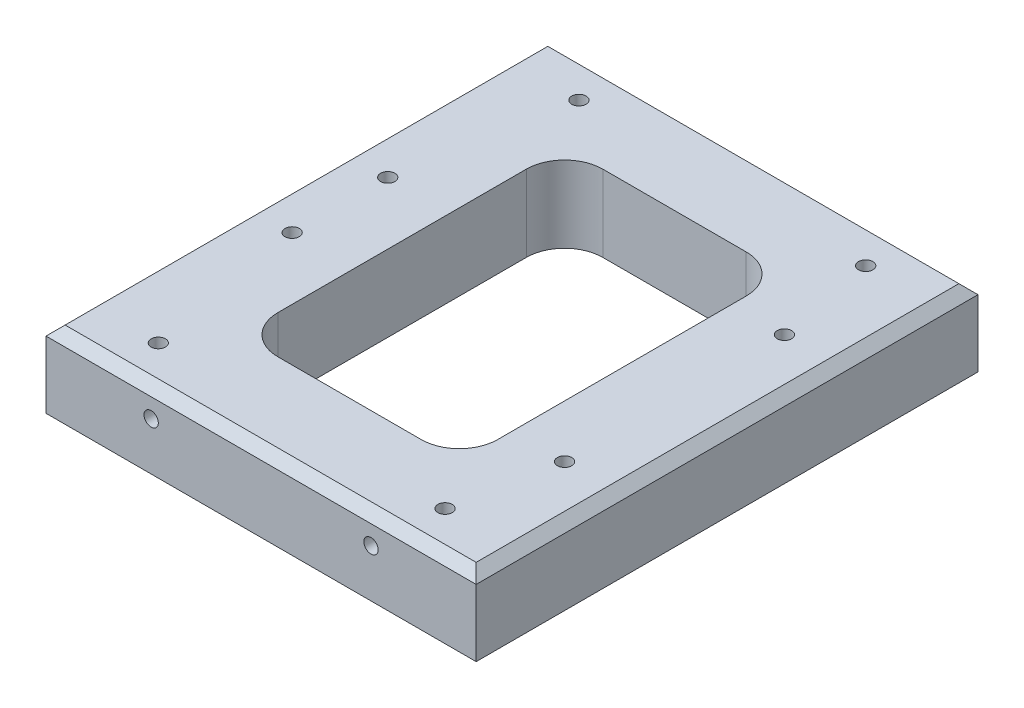
ISO-10303-21;
HEADER;
FILE_DESCRIPTION(('STEP AP214'),'2;1');
FILE_NAME('part.step','',(''),(''),'','','');
FILE_SCHEMA(('AUTOMOTIVE_DESIGN { 1 0 10303 214 1 1 1 1 }'));
ENDSEC;
DATA;
#1=APPLICATION_CONTEXT('core data for automotive mechanical design processes');
#2=APPLICATION_PROTOCOL_DEFINITION('international standard','automotive_design',2000,#1);
#3=PRODUCT_CONTEXT('',#1,'mechanical');
#4=PRODUCT('Part','Part','',(#3));
#5=PRODUCT_RELATED_PRODUCT_CATEGORY('part','',(#4));
#6=PRODUCT_DEFINITION_FORMATION('','',#4);
#7=PRODUCT_DEFINITION_CONTEXT('part definition',#1,'design');
#8=PRODUCT_DEFINITION('design','',#6,#7);
#9=PRODUCT_DEFINITION_SHAPE('','',#8);
#10=(LENGTH_UNIT() NAMED_UNIT(*) SI_UNIT(.MILLI.,.METRE.));
#11=(NAMED_UNIT(*) PLANE_ANGLE_UNIT() SI_UNIT($,.RADIAN.));
#12=(NAMED_UNIT(*) SI_UNIT($,.STERADIAN.) SOLID_ANGLE_UNIT());
#13=UNCERTAINTY_MEASURE_WITH_UNIT(LENGTH_MEASURE(1.E-05),#10,'distance_accuracy_value','');
#14=(GEOMETRIC_REPRESENTATION_CONTEXT(3) GLOBAL_UNCERTAINTY_ASSIGNED_CONTEXT((#13)) GLOBAL_UNIT_ASSIGNED_CONTEXT((#10,
#11,#12)) REPRESENTATION_CONTEXT('',''));
#15=CARTESIAN_POINT('',(0.,0.,0.));
#16=DIRECTION('',(0.,0.,1.));
#17=DIRECTION('',(1.,0.,0.));
#18=AXIS2_PLACEMENT_3D('',#15,#16,#17);
#19=CARTESIAN_POINT('',(0.,16.,0.));
#20=DIRECTION('',(0.,1.,0.));
#21=DIRECTION('',(0.,0.,1.));
#22=AXIS2_PLACEMENT_3D('',#19,#20,#21);
#23=PLANE('',#22);
#24=DIRECTION('',(-1.,0.,0.));
#25=VECTOR('',#24,1.);
#26=CARTESIAN_POINT('',(-45.,16.,-50.5));
#27=LINE('',#26,#25);
#28=CARTESIAN_POINT('',(43.,16.,-50.5));
#29=VERTEX_POINT('',#28);
#30=CARTESIAN_POINT('',(-43.,16.,-50.5));
#31=VERTEX_POINT('',#30);
#32=EDGE_CURVE('E242',#29,#31,#27,.T.);
#33=ORIENTED_EDGE('',*,*,#32,.T.);
#34=DIRECTION('',(0.,0.,1.));
#35=VECTOR('',#34,1.);
#36=CARTESIAN_POINT('',(-43.,16.,52.5));
#37=LINE('',#36,#35);
#38=CARTESIAN_POINT('',(-43.,16.,50.5));
#39=VERTEX_POINT('',#38);
#40=EDGE_CURVE('E244',#31,#39,#37,.T.);
#41=ORIENTED_EDGE('',*,*,#40,.T.);
#42=DIRECTION('',(1.,0.,0.));
#43=VECTOR('',#42,1.);
#44=CARTESIAN_POINT('',(45.,16.,50.5));
#45=LINE('',#44,#43);
#46=CARTESIAN_POINT('',(43.,16.,50.5));
#47=VERTEX_POINT('',#46);
#48=EDGE_CURVE('E238',#39,#47,#45,.T.);
#49=ORIENTED_EDGE('',*,*,#48,.T.);
#50=DIRECTION('',(0.,0.,-1.));
#51=VECTOR('',#50,1.);
#52=CARTESIAN_POINT('',(43.,16.,-52.5));
#53=LINE('',#52,#51);
#54=EDGE_CURVE('E240',#47,#29,#53,.T.);
#55=ORIENTED_EDGE('',*,*,#54,.T.);
#56=EDGE_LOOP('',(#33,#41,#49,#55));
#57=FACE_BOUND('',#56,.T.);
#58=CARTESIAN_POINT('',(34.,16.,-23.));
#59=DIRECTION('',(0.,1.,0.));
#60=DIRECTION('',(0.,0.,1.));
#61=AXIS2_PLACEMENT_3D('',#58,#59,#60);
#62=CIRCLE('',#61,1.5);
#63=CARTESIAN_POINT('',(34.,16.,-21.5));
#64=VERTEX_POINT('',#63);
#65=EDGE_CURVE('E277',#64,#64,#62,.T.);
#66=ORIENTED_EDGE('',*,*,#65,.F.);
#67=EDGE_LOOP('',(#66));
#68=FACE_BOUND('',#67,.T.);
#69=CARTESIAN_POINT('',(-36.,16.,10.));
#70=DIRECTION('',(0.,1.,0.));
#71=DIRECTION('',(0.,0.,1.));
#72=AXIS2_PLACEMENT_3D('',#69,#70,#71);
#73=CIRCLE('',#72,1.5);
#74=CARTESIAN_POINT('',(-36.,16.,11.5));
#75=VERTEX_POINT('',#74);
#76=EDGE_CURVE('E289',#75,#75,#73,.T.);
#77=ORIENTED_EDGE('',*,*,#76,.F.);
#78=EDGE_LOOP('',(#77));
#79=FACE_BOUND('',#78,.T.);
#80=CARTESIAN_POINT('',(30.,16.,44.));
#81=DIRECTION('',(0.,1.,0.));
#82=DIRECTION('',(0.,0.,1.));
#83=AXIS2_PLACEMENT_3D('',#80,#81,#82);
#84=CIRCLE('',#83,1.5);
#85=CARTESIAN_POINT('',(30.,16.,45.5));
#86=VERTEX_POINT('',#85);
#87=EDGE_CURVE('E301',#86,#86,#84,.T.);
#88=ORIENTED_EDGE('',*,*,#87,.F.);
#89=EDGE_LOOP('',(#88));
#90=FACE_BOUND('',#89,.T.);
#91=CARTESIAN_POINT('',(-30.,16.,-44.));
#92=DIRECTION('',(0.,1.,0.));
#93=DIRECTION('',(0.,0.,1.));
#94=AXIS2_PLACEMENT_3D('',#91,#92,#93);
#95=CIRCLE('',#94,1.5);
#96=CARTESIAN_POINT('',(-30.,16.,-42.5));
#97=VERTEX_POINT('',#96);
#98=EDGE_CURVE('E188',#97,#97,#95,.T.);
#99=ORIENTED_EDGE('',*,*,#98,.F.);
#100=EDGE_LOOP('',(#99));
#101=FACE_BOUND('',#100,.T.);
#102=DIRECTION('',(1.,0.,0.));
#103=VECTOR('',#102,1.);
#104=CARTESIAN_POINT('',(-14.9999999999999,16.,34.));
#105=LINE('',#104,#103);
#106=CARTESIAN_POINT('',(-14.9999999999999,16.,34.));
#107=VERTEX_POINT('',#106);
#108=CARTESIAN_POINT('',(15.,16.,34.));
#109=VERTEX_POINT('',#108);
#110=EDGE_CURVE('E156',#107,#109,#105,.T.);
#111=ORIENTED_EDGE('',*,*,#110,.F.);
#112=CARTESIAN_POINT('',(-15.,16.,26.));
#113=DIRECTION('',(0.,1.,0.));
#114=DIRECTION('',(0.,0.,-1.));
#115=AXIS2_PLACEMENT_3D('',#112,#113,#114);
#116=CIRCLE('',#115,8.);
#117=CARTESIAN_POINT('',(-23.,16.,25.9999999999999));
#118=VERTEX_POINT('',#117);
#119=EDGE_CURVE('E146',#118,#107,#116,.T.);
#120=ORIENTED_EDGE('',*,*,#119,.F.);
#121=DIRECTION('',(0.,0.,1.));
#122=VECTOR('',#121,1.);
#123=CARTESIAN_POINT('',(-23.,16.,25.9999999999999));
#124=LINE('',#123,#122);
#125=CARTESIAN_POINT('',(-23.,16.,-26.));
#126=VERTEX_POINT('',#125);
#127=EDGE_CURVE('E184',#126,#118,#124,.T.);
#128=ORIENTED_EDGE('',*,*,#127,.F.);
#129=CARTESIAN_POINT('',(-15.,16.,-26.));
#130=DIRECTION('',(0.,1.,0.));
#131=DIRECTION('',(0.,0.,-1.));
#132=AXIS2_PLACEMENT_3D('',#129,#130,#131);
#133=CIRCLE('',#132,8.);
#134=CARTESIAN_POINT('',(-14.9999999999999,16.,-34.));
#135=VERTEX_POINT('',#134);
#136=EDGE_CURVE('E181',#135,#126,#133,.T.);
#137=ORIENTED_EDGE('',*,*,#136,.F.);
#138=DIRECTION('',(-1.,0.,0.));
#139=VECTOR('',#138,1.);
#140=CARTESIAN_POINT('',(-14.9999999999999,16.,-34.));
#141=LINE('',#140,#139);
#142=CARTESIAN_POINT('',(15.,16.,-34.));
#143=VERTEX_POINT('',#142);
#144=EDGE_CURVE('E179',#143,#135,#141,.T.);
#145=ORIENTED_EDGE('',*,*,#144,.F.);
#146=CARTESIAN_POINT('',(15.,16.,-26.));
#147=DIRECTION('',(0.,1.,0.));
#148=DIRECTION('',(0.,0.,-1.));
#149=AXIS2_PLACEMENT_3D('',#146,#147,#148);
#150=CIRCLE('',#149,8.);
#151=CARTESIAN_POINT('',(23.,16.,-26.));
#152=VERTEX_POINT('',#151);
#153=EDGE_CURVE('E177',#152,#143,#150,.T.);
#154=ORIENTED_EDGE('',*,*,#153,.F.);
#155=DIRECTION('',(0.,0.,-1.));
#156=VECTOR('',#155,1.);
#157=CARTESIAN_POINT('',(23.,16.,25.9999999999999));
#158=LINE('',#157,#156);
#159=CARTESIAN_POINT('',(23.,16.,25.9999999999999));
#160=VERTEX_POINT('',#159);
#161=EDGE_CURVE('E172',#160,#152,#158,.T.);
#162=ORIENTED_EDGE('',*,*,#161,.F.);
#163=CARTESIAN_POINT('',(15.,16.,26.));
#164=DIRECTION('',(0.,1.,0.));
#165=DIRECTION('',(0.,0.,1.));
#166=AXIS2_PLACEMENT_3D('',#163,#164,#165);
#167=CIRCLE('',#166,8.);
#168=EDGE_CURVE('E170',#109,#160,#167,.T.);
#169=ORIENTED_EDGE('',*,*,#168,.F.);
#170=EDGE_LOOP('',(#111,#120,#128,#137,#145,#154,#162,#169));
#171=FACE_BOUND('',#170,.T.);
#172=CARTESIAN_POINT('',(30.,16.,-44.));
#173=DIRECTION('',(0.,1.,0.));
#174=DIRECTION('',(0.,0.,1.));
#175=AXIS2_PLACEMENT_3D('',#172,#173,#174);
#176=CIRCLE('',#175,1.5);
#177=CARTESIAN_POINT('',(30.,16.,-42.5));
#178=VERTEX_POINT('',#177);
#179=EDGE_CURVE('E307',#178,#178,#176,.T.);
#180=ORIENTED_EDGE('',*,*,#179,.F.);
#181=EDGE_LOOP('',(#180));
#182=FACE_BOUND('',#181,.T.);
#183=CARTESIAN_POINT('',(-30.,16.,44.));
#184=DIRECTION('',(0.,1.,0.));
#185=DIRECTION('',(0.,0.,1.));
#186=AXIS2_PLACEMENT_3D('',#183,#184,#185);
#187=CIRCLE('',#186,1.5);
#188=CARTESIAN_POINT('',(-30.,16.,45.5));
#189=VERTEX_POINT('',#188);
#190=EDGE_CURVE('E295',#189,#189,#187,.T.);
#191=ORIENTED_EDGE('',*,*,#190,.F.);
#192=EDGE_LOOP('',(#191));
#193=FACE_BOUND('',#192,.T.);
#194=CARTESIAN_POINT('',(-36.,16.,-10.));
#195=DIRECTION('',(0.,1.,0.));
#196=DIRECTION('',(0.,0.,-1.));
#197=AXIS2_PLACEMENT_3D('',#194,#195,#196);
#198=CIRCLE('',#197,1.5);
#199=CARTESIAN_POINT('',(-36.,16.,-11.5));
#200=VERTEX_POINT('',#199);
#201=EDGE_CURVE('E283',#200,#200,#198,.T.);
#202=ORIENTED_EDGE('',*,*,#201,.F.);
#203=EDGE_LOOP('',(#202));
#204=FACE_BOUND('',#203,.T.);
#205=CARTESIAN_POINT('',(34.,16.,23.));
#206=DIRECTION('',(0.,1.,0.));
#207=DIRECTION('',(0.,0.,-1.));
#208=AXIS2_PLACEMENT_3D('',#205,#206,#207);
#209=CIRCLE('',#208,1.5);
#210=CARTESIAN_POINT('',(34.,16.,21.5));
#211=VERTEX_POINT('',#210);
#212=EDGE_CURVE('E268',#211,#211,#209,.T.);
#213=ORIENTED_EDGE('',*,*,#212,.F.);
#214=EDGE_LOOP('',(#213));
#215=FACE_BOUND('',#214,.T.);
#216=ADVANCED_FACE('F42',(#57,#68,#79,#90,#101,#171,#182,#193,#204,#215),#23,.T.);
#217=CARTESIAN_POINT('',(0.,0.,0.));
#218=DIRECTION('',(0.,1.,0.));
#219=DIRECTION('',(0.,0.,1.));
#220=AXIS2_PLACEMENT_3D('',#217,#218,#219);
#221=PLANE('',#220);
#222=DIRECTION('',(0.,0.,-1.));
#223=VECTOR('',#222,1.);
#224=CARTESIAN_POINT('',(45.,0.,-52.5));
#225=LINE('',#224,#223);
#226=CARTESIAN_POINT('',(45.,0.,52.5));
#227=VERTEX_POINT('',#226);
#228=CARTESIAN_POINT('',(45.,0.,-52.5));
#229=VERTEX_POINT('',#228);
#230=EDGE_CURVE('E164',#227,#229,#225,.T.);
#231=ORIENTED_EDGE('',*,*,#230,.F.);
#232=DIRECTION('',(1.,0.,0.));
#233=VECTOR('',#232,1.);
#234=CARTESIAN_POINT('',(-45.,0.,52.5));
#235=LINE('',#234,#233);
#236=CARTESIAN_POINT('',(-45.,0.,52.5));
#237=VERTEX_POINT('',#236);
#238=EDGE_CURVE('E227',#237,#227,#235,.T.);
#239=ORIENTED_EDGE('',*,*,#238,.F.);
#240=DIRECTION('',(0.,0.,1.));
#241=VECTOR('',#240,1.);
#242=CARTESIAN_POINT('',(-45.,0.,-52.5));
#243=LINE('',#242,#241);
#244=CARTESIAN_POINT('',(-45.,0.,-52.5));
#245=VERTEX_POINT('',#244);
#246=EDGE_CURVE('E224',#245,#237,#243,.T.);
#247=ORIENTED_EDGE('',*,*,#246,.F.);
#248=DIRECTION('',(-1.,0.,0.));
#249=VECTOR('',#248,1.);
#250=CARTESIAN_POINT('',(-45.,0.,-52.5));
#251=LINE('',#250,#249);
#252=EDGE_CURVE('E221',#229,#245,#251,.T.);
#253=ORIENTED_EDGE('',*,*,#252,.F.);
#254=EDGE_LOOP('',(#231,#239,#247,#253));
#255=FACE_BOUND('',#254,.T.);
#256=CARTESIAN_POINT('',(-15.,0.,26.));
#257=DIRECTION('',(0.,1.,0.));
#258=DIRECTION('',(0.,0.,-1.));
#259=AXIS2_PLACEMENT_3D('',#256,#257,#258);
#260=CIRCLE('',#259,8.);
#261=CARTESIAN_POINT('',(-23.,0.,25.9999999999999));
#262=VERTEX_POINT('',#261);
#263=CARTESIAN_POINT('',(-14.9999999999999,0.,34.));
#264=VERTEX_POINT('',#263);
#265=EDGE_CURVE('E186',#262,#264,#260,.T.);
#266=ORIENTED_EDGE('',*,*,#265,.T.);
#267=DIRECTION('',(1.,0.,0.));
#268=VECTOR('',#267,1.);
#269=CARTESIAN_POINT('',(-14.9999999999999,0.,34.));
#270=LINE('',#269,#268);
#271=CARTESIAN_POINT('',(15.,0.,34.));
#272=VERTEX_POINT('',#271);
#273=EDGE_CURVE('E163',#264,#272,#270,.T.);
#274=ORIENTED_EDGE('',*,*,#273,.T.);
#275=CARTESIAN_POINT('',(15.,0.,26.));
#276=DIRECTION('',(0.,1.,0.));
#277=DIRECTION('',(0.,0.,1.));
#278=AXIS2_PLACEMENT_3D('',#275,#276,#277);
#279=CIRCLE('',#278,8.);
#280=CARTESIAN_POINT('',(23.,0.,25.9999999999999));
#281=VERTEX_POINT('',#280);
#282=EDGE_CURVE('E190',#272,#281,#279,.T.);
#283=ORIENTED_EDGE('',*,*,#282,.T.);
#284=DIRECTION('',(0.,0.,-1.));
#285=VECTOR('',#284,1.);
#286=CARTESIAN_POINT('',(23.,0.,25.9999999999999));
#287=LINE('',#286,#285);
#288=CARTESIAN_POINT('',(23.,0.,-26.));
#289=VERTEX_POINT('',#288);
#290=EDGE_CURVE('E193',#281,#289,#287,.T.);
#291=ORIENTED_EDGE('',*,*,#290,.T.);
#292=CARTESIAN_POINT('',(15.,0.,-26.));
#293=DIRECTION('',(0.,1.,0.));
#294=DIRECTION('',(0.,0.,-1.));
#295=AXIS2_PLACEMENT_3D('',#292,#293,#294);
#296=CIRCLE('',#295,8.);
#297=CARTESIAN_POINT('',(15.,0.,-34.));
#298=VERTEX_POINT('',#297);
#299=EDGE_CURVE('E196',#289,#298,#296,.T.);
#300=ORIENTED_EDGE('',*,*,#299,.T.);
#301=DIRECTION('',(-1.,0.,0.));
#302=VECTOR('',#301,1.);
#303=CARTESIAN_POINT('',(-14.9999999999999,0.,-34.));
#304=LINE('',#303,#302);
#305=CARTESIAN_POINT('',(-14.9999999999999,0.,-34.));
#306=VERTEX_POINT('',#305);
#307=EDGE_CURVE('E199',#298,#306,#304,.T.);
#308=ORIENTED_EDGE('',*,*,#307,.T.);
#309=CARTESIAN_POINT('',(-15.,0.,-26.));
#310=DIRECTION('',(0.,1.,0.));
#311=DIRECTION('',(0.,0.,-1.));
#312=AXIS2_PLACEMENT_3D('',#309,#310,#311);
#313=CIRCLE('',#312,8.);
#314=CARTESIAN_POINT('',(-23.,0.,-26.));
#315=VERTEX_POINT('',#314);
#316=EDGE_CURVE('E202',#306,#315,#313,.T.);
#317=ORIENTED_EDGE('',*,*,#316,.T.);
#318=DIRECTION('',(0.,0.,1.));
#319=VECTOR('',#318,1.);
#320=CARTESIAN_POINT('',(-23.,0.,25.9999999999999));
#321=LINE('',#320,#319);
#322=EDGE_CURVE('E157',#315,#262,#321,.T.);
#323=ORIENTED_EDGE('',*,*,#322,.T.);
#324=EDGE_LOOP('',(#266,#274,#283,#291,#300,#308,#317,#323));
#325=FACE_BOUND('',#324,.T.);
#326=CARTESIAN_POINT('',(-30.,0.,-44.));
#327=DIRECTION('',(0.,1.,0.));
#328=DIRECTION('',(0.,0.,1.));
#329=AXIS2_PLACEMENT_3D('',#326,#327,#328);
#330=CIRCLE('',#329,1.5);
#331=CARTESIAN_POINT('',(-30.,0.,-42.5));
#332=VERTEX_POINT('',#331);
#333=EDGE_CURVE('E310',#332,#332,#330,.T.);
#334=ORIENTED_EDGE('',*,*,#333,.T.);
#335=EDGE_LOOP('',(#334));
#336=FACE_BOUND('',#335,.T.);
#337=CARTESIAN_POINT('',(30.,0.,-44.));
#338=DIRECTION('',(0.,1.,0.));
#339=DIRECTION('',(0.,0.,1.));
#340=AXIS2_PLACEMENT_3D('',#337,#338,#339);
#341=CIRCLE('',#340,1.5);
#342=CARTESIAN_POINT('',(30.,0.,-42.5));
#343=VERTEX_POINT('',#342);
#344=EDGE_CURVE('E304',#343,#343,#341,.T.);
#345=ORIENTED_EDGE('',*,*,#344,.T.);
#346=EDGE_LOOP('',(#345));
#347=FACE_BOUND('',#346,.T.);
#348=CARTESIAN_POINT('',(30.,0.,44.));
#349=DIRECTION('',(0.,1.,0.));
#350=DIRECTION('',(0.,0.,1.));
#351=AXIS2_PLACEMENT_3D('',#348,#349,#350);
#352=CIRCLE('',#351,1.5);
#353=CARTESIAN_POINT('',(30.,0.,45.5));
#354=VERTEX_POINT('',#353);
#355=EDGE_CURVE('E298',#354,#354,#352,.T.);
#356=ORIENTED_EDGE('',*,*,#355,.T.);
#357=EDGE_LOOP('',(#356));
#358=FACE_BOUND('',#357,.T.);
#359=CARTESIAN_POINT('',(-30.,0.,44.));
#360=DIRECTION('',(0.,1.,0.));
#361=DIRECTION('',(0.,0.,1.));
#362=AXIS2_PLACEMENT_3D('',#359,#360,#361);
#363=CIRCLE('',#362,1.5);
#364=CARTESIAN_POINT('',(-30.,0.,45.5));
#365=VERTEX_POINT('',#364);
#366=EDGE_CURVE('E292',#365,#365,#363,.T.);
#367=ORIENTED_EDGE('',*,*,#366,.T.);
#368=EDGE_LOOP('',(#367));
#369=FACE_BOUND('',#368,.T.);
#370=CARTESIAN_POINT('',(-36.,0.,10.));
#371=DIRECTION('',(0.,1.,0.));
#372=DIRECTION('',(0.,0.,1.));
#373=AXIS2_PLACEMENT_3D('',#370,#371,#372);
#374=CIRCLE('',#373,1.5);
#375=CARTESIAN_POINT('',(-36.,0.,11.5));
#376=VERTEX_POINT('',#375);
#377=EDGE_CURVE('E286',#376,#376,#374,.T.);
#378=ORIENTED_EDGE('',*,*,#377,.T.);
#379=EDGE_LOOP('',(#378));
#380=FACE_BOUND('',#379,.T.);
#381=CARTESIAN_POINT('',(-36.,0.,-10.));
#382=DIRECTION('',(0.,1.,0.));
#383=DIRECTION('',(0.,0.,-1.));
#384=AXIS2_PLACEMENT_3D('',#381,#382,#383);
#385=CIRCLE('',#384,1.5);
#386=CARTESIAN_POINT('',(-36.,0.,-11.5));
#387=VERTEX_POINT('',#386);
#388=EDGE_CURVE('E280',#387,#387,#385,.T.);
#389=ORIENTED_EDGE('',*,*,#388,.T.);
#390=EDGE_LOOP('',(#389));
#391=FACE_BOUND('',#390,.T.);
#392=CARTESIAN_POINT('',(34.,0.,-23.));
#393=DIRECTION('',(0.,1.,0.));
#394=DIRECTION('',(0.,0.,1.));
#395=AXIS2_PLACEMENT_3D('',#392,#393,#394);
#396=CIRCLE('',#395,1.5);
#397=CARTESIAN_POINT('',(34.,0.,-21.5));
#398=VERTEX_POINT('',#397);
#399=EDGE_CURVE('E273',#398,#398,#396,.T.);
#400=ORIENTED_EDGE('',*,*,#399,.T.);
#401=EDGE_LOOP('',(#400));
#402=FACE_BOUND('',#401,.T.);
#403=CARTESIAN_POINT('',(34.,0.,23.));
#404=DIRECTION('',(0.,1.,0.));
#405=DIRECTION('',(0.,0.,-1.));
#406=AXIS2_PLACEMENT_3D('',#403,#404,#405);
#407=CIRCLE('',#406,1.5);
#408=CARTESIAN_POINT('',(34.,0.,21.5));
#409=VERTEX_POINT('',#408);
#410=EDGE_CURVE('E263',#409,#409,#407,.T.);
#411=ORIENTED_EDGE('',*,*,#410,.T.);
#412=EDGE_LOOP('',(#411));
#413=FACE_BOUND('',#412,.T.);
#414=ADVANCED_FACE('F317',(#255,#325,#336,#347,#358,#369,#380,#391,#402,#413),#221,.F.);
#415=CARTESIAN_POINT('',(45.,16.,-52.5));
#416=DIRECTION('',(-1.,0.,0.));
#417=DIRECTION('',(0.,0.,1.));
#418=AXIS2_PLACEMENT_3D('',#415,#416,#417);
#419=PLANE('',#418);
#420=DIRECTION('',(0.,-1.,0.));
#421=VECTOR('',#420,1.);
#422=CARTESIAN_POINT('',(45.,16.,-52.5));
#423=LINE('',#422,#421);
#424=CARTESIAN_POINT('',(45.,14.,-52.5));
#425=VERTEX_POINT('',#424);
#426=EDGE_CURVE('E236',#425,#229,#423,.T.);
#427=ORIENTED_EDGE('',*,*,#426,.F.);
#428=DIRECTION('',(0.,0.,1.));
#429=VECTOR('',#428,1.);
#430=CARTESIAN_POINT('',(45.,14.,52.5));
#431=LINE('',#430,#429);
#432=CARTESIAN_POINT('',(45.,14.,52.5));
#433=VERTEX_POINT('',#432);
#434=EDGE_CURVE('E52',#425,#433,#431,.T.);
#435=ORIENTED_EDGE('',*,*,#434,.T.);
#436=DIRECTION('',(0.,-1.,0.));
#437=VECTOR('',#436,1.);
#438=CARTESIAN_POINT('',(45.,16.,52.5));
#439=LINE('',#438,#437);
#440=EDGE_CURVE('E230',#433,#227,#439,.T.);
#441=ORIENTED_EDGE('',*,*,#440,.T.);
#442=ORIENTED_EDGE('',*,*,#230,.T.);
#443=EDGE_LOOP('',(#427,#435,#441,#442));
#444=FACE_BOUND('',#443,.T.);
#445=ADVANCED_FACE('F342',(#444),#419,.F.);
#446=CARTESIAN_POINT('',(-45.,16.,-52.5));
#447=DIRECTION('',(0.,0.,1.));
#448=DIRECTION('',(1.,0.,0.));
#449=AXIS2_PLACEMENT_3D('',#446,#447,#448);
#450=PLANE('',#449);
#451=CARTESIAN_POINT('',(-23.,10.,-52.5));
#452=DIRECTION('',(0.,0.,1.));
#453=DIRECTION('',(1.,0.,0.));
#454=AXIS2_PLACEMENT_3D('',#451,#452,#453);
#455=CIRCLE('',#454,1.5);
#456=CARTESIAN_POINT('',(-21.5,10.,-52.5));
#457=VERTEX_POINT('',#456);
#458=EDGE_CURVE('E649',#457,#457,#455,.T.);
#459=ORIENTED_EDGE('',*,*,#458,.T.);
#460=EDGE_LOOP('',(#459));
#461=FACE_BOUND('',#460,.T.);
#462=CARTESIAN_POINT('',(23.,10.,-52.5));
#463=DIRECTION('',(0.,0.,1.));
#464=DIRECTION('',(-1.,0.,0.));
#465=AXIS2_PLACEMENT_3D('',#462,#463,#464);
#466=CIRCLE('',#465,1.5);
#467=CARTESIAN_POINT('',(21.5,10.,-52.5));
#468=VERTEX_POINT('',#467);
#469=EDGE_CURVE('E659',#468,#468,#466,.T.);
#470=ORIENTED_EDGE('',*,*,#469,.T.);
#471=EDGE_LOOP('',(#470));
#472=FACE_BOUND('',#471,.T.);
#473=DIRECTION('',(0.,-1.,0.));
#474=VECTOR('',#473,1.);
#475=CARTESIAN_POINT('',(-45.,16.,-52.5));
#476=LINE('',#475,#474);
#477=CARTESIAN_POINT('',(-45.,14.,-52.5));
#478=VERTEX_POINT('',#477);
#479=EDGE_CURVE('E234',#478,#245,#476,.T.);
#480=ORIENTED_EDGE('',*,*,#479,.F.);
#481=DIRECTION('',(1.,0.,0.));
#482=VECTOR('',#481,1.);
#483=CARTESIAN_POINT('',(45.,14.,-52.5));
#484=LINE('',#483,#482);
#485=EDGE_CURVE('E67',#478,#425,#484,.T.);
#486=ORIENTED_EDGE('',*,*,#485,.T.);
#487=ORIENTED_EDGE('',*,*,#426,.T.);
#488=ORIENTED_EDGE('',*,*,#252,.T.);
#489=EDGE_LOOP('',(#480,#486,#487,#488));
#490=FACE_BOUND('',#489,.T.);
#491=ADVANCED_FACE('F356',(#461,#472,#490),#450,.F.);
#492=CARTESIAN_POINT('',(-45.,16.,-52.5));
#493=DIRECTION('',(1.,0.,0.));
#494=DIRECTION('',(0.,0.,-1.));
#495=AXIS2_PLACEMENT_3D('',#492,#493,#494);
#496=PLANE('',#495);
#497=DIRECTION('',(0.,-1.,0.));
#498=VECTOR('',#497,1.);
#499=CARTESIAN_POINT('',(-45.,16.,52.5));
#500=LINE('',#499,#498);
#501=CARTESIAN_POINT('',(-45.,14.,52.5));
#502=VERTEX_POINT('',#501);
#503=EDGE_CURVE('E232',#502,#237,#500,.T.);
#504=ORIENTED_EDGE('',*,*,#503,.F.);
#505=DIRECTION('',(0.,0.,-1.));
#506=VECTOR('',#505,1.);
#507=CARTESIAN_POINT('',(-45.,14.,-52.5));
#508=LINE('',#507,#506);
#509=EDGE_CURVE('E247',#502,#478,#508,.T.);
#510=ORIENTED_EDGE('',*,*,#509,.T.);
#511=ORIENTED_EDGE('',*,*,#479,.T.);
#512=ORIENTED_EDGE('',*,*,#246,.T.);
#513=EDGE_LOOP('',(#504,#510,#511,#512));
#514=FACE_BOUND('',#513,.T.);
#515=ADVANCED_FACE('F352',(#514),#496,.F.);
#516=CARTESIAN_POINT('',(-45.,16.,52.5));
#517=DIRECTION('',(0.,0.,-1.));
#518=DIRECTION('',(-1.,0.,0.));
#519=AXIS2_PLACEMENT_3D('',#516,#517,#518);
#520=PLANE('',#519);
#521=CARTESIAN_POINT('',(-23.,10.,52.5));
#522=DIRECTION('',(0.,0.,1.));
#523=DIRECTION('',(1.,0.,0.));
#524=AXIS2_PLACEMENT_3D('',#521,#522,#523);
#525=CIRCLE('',#524,1.5);
#526=CARTESIAN_POINT('',(-21.5,10.,52.5));
#527=VERTEX_POINT('',#526);
#528=EDGE_CURVE('E664',#527,#527,#525,.T.);
#529=ORIENTED_EDGE('',*,*,#528,.F.);
#530=EDGE_LOOP('',(#529));
#531=FACE_BOUND('',#530,.T.);
#532=CARTESIAN_POINT('',(23.,10.,52.5));
#533=DIRECTION('',(0.,0.,1.));
#534=DIRECTION('',(-1.,0.,0.));
#535=AXIS2_PLACEMENT_3D('',#532,#533,#534);
#536=CIRCLE('',#535,1.5);
#537=CARTESIAN_POINT('',(21.5,10.,52.5));
#538=VERTEX_POINT('',#537);
#539=EDGE_CURVE('E648',#538,#538,#536,.T.);
#540=ORIENTED_EDGE('',*,*,#539,.F.);
#541=EDGE_LOOP('',(#540));
#542=FACE_BOUND('',#541,.T.);
#543=ORIENTED_EDGE('',*,*,#440,.F.);
#544=DIRECTION('',(-1.,0.,0.));
#545=VECTOR('',#544,1.);
#546=CARTESIAN_POINT('',(-45.,14.,52.5));
#547=LINE('',#546,#545);
#548=EDGE_CURVE('E11',#433,#502,#547,.T.);
#549=ORIENTED_EDGE('',*,*,#548,.T.);
#550=ORIENTED_EDGE('',*,*,#503,.T.);
#551=ORIENTED_EDGE('',*,*,#238,.T.);
#552=EDGE_LOOP('',(#543,#549,#550,#551));
#553=FACE_BOUND('',#552,.T.);
#554=ADVANCED_FACE('F349',(#531,#542,#553),#520,.F.);
#555=CARTESIAN_POINT('',(-15.,16.,26.));
#556=DIRECTION('',(0.,-1.,0.));
#557=DIRECTION('',(0.,0.,-1.));
#558=AXIS2_PLACEMENT_3D('',#555,#556,#557);
#559=CYLINDRICAL_SURFACE('',#558,8.);
#560=ORIENTED_EDGE('',*,*,#265,.F.);
#561=DIRECTION('',(0.,-1.,0.));
#562=VECTOR('',#561,1.);
#563=CARTESIAN_POINT('',(-23.,16.,25.9999999999999));
#564=LINE('',#563,#562);
#565=EDGE_CURVE('E152',#118,#262,#564,.T.);
#566=ORIENTED_EDGE('',*,*,#565,.F.);
#567=ORIENTED_EDGE('',*,*,#119,.T.);
#568=DIRECTION('',(0.,-1.,0.));
#569=VECTOR('',#568,1.);
#570=CARTESIAN_POINT('',(-14.9999999999999,16.,34.));
#571=LINE('',#570,#569);
#572=EDGE_CURVE('E149',#107,#264,#571,.T.);
#573=ORIENTED_EDGE('',*,*,#572,.T.);
#574=EDGE_LOOP('',(#560,#566,#567,#573));
#575=FACE_BOUND('',#574,.T.);
#576=ADVANCED_FACE('F148',(#575),#559,.F.);
#577=CARTESIAN_POINT('',(-14.9999999999999,16.,34.));
#578=DIRECTION('',(0.,0.,-1.));
#579=DIRECTION('',(-1.,0.,0.));
#580=AXIS2_PLACEMENT_3D('',#577,#578,#579);
#581=PLANE('',#580);
#582=ORIENTED_EDGE('',*,*,#273,.F.);
#583=ORIENTED_EDGE('',*,*,#572,.F.);
#584=ORIENTED_EDGE('',*,*,#110,.T.);
#585=DIRECTION('',(0.,-1.,0.));
#586=VECTOR('',#585,1.);
#587=CARTESIAN_POINT('',(15.,16.,34.));
#588=LINE('',#587,#586);
#589=EDGE_CURVE('E165',#109,#272,#588,.T.);
#590=ORIENTED_EDGE('',*,*,#589,.T.);
#591=EDGE_LOOP('',(#582,#583,#584,#590));
#592=FACE_BOUND('',#591,.T.);
#593=ADVANCED_FACE('F160',(#592),#581,.T.);
#594=CARTESIAN_POINT('',(15.,16.,26.));
#595=DIRECTION('',(0.,-1.,0.));
#596=DIRECTION('',(0.,0.,-1.));
#597=AXIS2_PLACEMENT_3D('',#594,#595,#596);
#598=CYLINDRICAL_SURFACE('',#597,8.);
#599=ORIENTED_EDGE('',*,*,#282,.F.);
#600=ORIENTED_EDGE('',*,*,#589,.F.);
#601=ORIENTED_EDGE('',*,*,#168,.T.);
#602=DIRECTION('',(0.,-1.,0.));
#603=VECTOR('',#602,1.);
#604=CARTESIAN_POINT('',(23.,16.,25.9999999999999));
#605=LINE('',#604,#603);
#606=EDGE_CURVE('E216',#160,#281,#605,.T.);
#607=ORIENTED_EDGE('',*,*,#606,.T.);
#608=EDGE_LOOP('',(#599,#600,#601,#607));
#609=FACE_BOUND('',#608,.T.);
#610=ADVANCED_FACE('F425',(#609),#598,.F.);
#611=CARTESIAN_POINT('',(23.,16.,25.9999999999999));
#612=DIRECTION('',(-1.,0.,0.));
#613=DIRECTION('',(0.,0.,1.));
#614=AXIS2_PLACEMENT_3D('',#611,#612,#613);
#615=PLANE('',#614);
#616=ORIENTED_EDGE('',*,*,#290,.F.);
#617=ORIENTED_EDGE('',*,*,#606,.F.);
#618=ORIENTED_EDGE('',*,*,#161,.T.);
#619=DIRECTION('',(0.,-1.,0.));
#620=VECTOR('',#619,1.);
#621=CARTESIAN_POINT('',(23.,16.,-26.));
#622=LINE('',#621,#620);
#623=EDGE_CURVE('E214',#152,#289,#622,.T.);
#624=ORIENTED_EDGE('',*,*,#623,.T.);
#625=EDGE_LOOP('',(#616,#617,#618,#624));
#626=FACE_BOUND('',#625,.T.);
#627=ADVANCED_FACE('F422',(#626),#615,.T.);
#628=CARTESIAN_POINT('',(15.,16.,-26.));
#629=DIRECTION('',(0.,-1.,0.));
#630=DIRECTION('',(0.,0.,-1.));
#631=AXIS2_PLACEMENT_3D('',#628,#629,#630);
#632=CYLINDRICAL_SURFACE('',#631,8.);
#633=ORIENTED_EDGE('',*,*,#299,.F.);
#634=ORIENTED_EDGE('',*,*,#623,.F.);
#635=ORIENTED_EDGE('',*,*,#153,.T.);
#636=DIRECTION('',(0.,-1.,0.));
#637=VECTOR('',#636,1.);
#638=CARTESIAN_POINT('',(15.,16.,-34.));
#639=LINE('',#638,#637);
#640=EDGE_CURVE('E212',#143,#298,#639,.T.);
#641=ORIENTED_EDGE('',*,*,#640,.T.);
#642=EDGE_LOOP('',(#633,#634,#635,#641));
#643=FACE_BOUND('',#642,.T.);
#644=ADVANCED_FACE('F417',(#643),#632,.F.);
#645=CARTESIAN_POINT('',(-14.9999999999999,16.,-34.));
#646=DIRECTION('',(0.,0.,1.));
#647=DIRECTION('',(1.,0.,0.));
#648=AXIS2_PLACEMENT_3D('',#645,#646,#647);
#649=PLANE('',#648);
#650=ORIENTED_EDGE('',*,*,#307,.F.);
#651=ORIENTED_EDGE('',*,*,#640,.F.);
#652=ORIENTED_EDGE('',*,*,#144,.T.);
#653=DIRECTION('',(0.,-1.,0.));
#654=VECTOR('',#653,1.);
#655=CARTESIAN_POINT('',(-14.9999999999999,16.,-34.));
#656=LINE('',#655,#654);
#657=EDGE_CURVE('E210',#135,#306,#656,.T.);
#658=ORIENTED_EDGE('',*,*,#657,.T.);
#659=EDGE_LOOP('',(#650,#651,#652,#658));
#660=FACE_BOUND('',#659,.T.);
#661=ADVANCED_FACE('F413',(#660),#649,.T.);
#662=CARTESIAN_POINT('',(-15.,16.,-26.));
#663=DIRECTION('',(0.,-1.,0.));
#664=DIRECTION('',(0.,0.,-1.));
#665=AXIS2_PLACEMENT_3D('',#662,#663,#664);
#666=CYLINDRICAL_SURFACE('',#665,8.);
#667=ORIENTED_EDGE('',*,*,#316,.F.);
#668=ORIENTED_EDGE('',*,*,#657,.F.);
#669=ORIENTED_EDGE('',*,*,#136,.T.);
#670=DIRECTION('',(0.,-1.,0.));
#671=VECTOR('',#670,1.);
#672=CARTESIAN_POINT('',(-23.,16.,-26.));
#673=LINE('',#672,#671);
#674=EDGE_CURVE('E208',#126,#315,#673,.T.);
#675=ORIENTED_EDGE('',*,*,#674,.T.);
#676=EDGE_LOOP('',(#667,#668,#669,#675));
#677=FACE_BOUND('',#676,.T.);
#678=ADVANCED_FACE('F333',(#677),#666,.F.);
#679=CARTESIAN_POINT('',(-23.,16.,25.9999999999999));
#680=DIRECTION('',(1.,0.,0.));
#681=DIRECTION('',(0.,0.,-1.));
#682=AXIS2_PLACEMENT_3D('',#679,#680,#681);
#683=PLANE('',#682);
#684=ORIENTED_EDGE('',*,*,#322,.F.);
#685=ORIENTED_EDGE('',*,*,#674,.F.);
#686=ORIENTED_EDGE('',*,*,#127,.T.);
#687=ORIENTED_EDGE('',*,*,#565,.T.);
#688=EDGE_LOOP('',(#684,#685,#686,#687));
#689=FACE_BOUND('',#688,.T.);
#690=ADVANCED_FACE('F323',(#689),#683,.T.);
#691=CARTESIAN_POINT('',(-30.,16.,-44.));
#692=DIRECTION('',(0.,-1.,0.));
#693=DIRECTION('',(0.,0.,-1.));
#694=AXIS2_PLACEMENT_3D('',#691,#692,#693);
#695=CYLINDRICAL_SURFACE('',#694,1.5);
#696=ORIENTED_EDGE('',*,*,#98,.T.);
#697=EDGE_LOOP('',(#696));
#698=FACE_BOUND('',#697,.T.);
#699=ORIENTED_EDGE('',*,*,#333,.F.);
#700=EDGE_LOOP('',(#699));
#701=FACE_BOUND('',#700,.T.);
#702=ADVANCED_FACE('F320',(#698,#701),#695,.F.);
#703=CARTESIAN_POINT('',(30.,16.,-44.));
#704=DIRECTION('',(0.,-1.,0.));
#705=DIRECTION('',(0.,0.,-1.));
#706=AXIS2_PLACEMENT_3D('',#703,#704,#705);
#707=CYLINDRICAL_SURFACE('',#706,1.5);
#708=ORIENTED_EDGE('',*,*,#179,.T.);
#709=EDGE_LOOP('',(#708));
#710=FACE_BOUND('',#709,.T.);
#711=ORIENTED_EDGE('',*,*,#344,.F.);
#712=EDGE_LOOP('',(#711));
#713=FACE_BOUND('',#712,.T.);
#714=ADVANCED_FACE('F322',(#710,#713),#707,.F.);
#715=CARTESIAN_POINT('',(30.,16.,44.));
#716=DIRECTION('',(0.,-1.,0.));
#717=DIRECTION('',(0.,0.,-1.));
#718=AXIS2_PLACEMENT_3D('',#715,#716,#717);
#719=CYLINDRICAL_SURFACE('',#718,1.5);
#720=ORIENTED_EDGE('',*,*,#87,.T.);
#721=EDGE_LOOP('',(#720));
#722=FACE_BOUND('',#721,.T.);
#723=ORIENTED_EDGE('',*,*,#355,.F.);
#724=EDGE_LOOP('',(#723));
#725=FACE_BOUND('',#724,.T.);
#726=ADVANCED_FACE('F330',(#722,#725),#719,.F.);
#727=CARTESIAN_POINT('',(-30.,16.,44.));
#728=DIRECTION('',(0.,-1.,0.));
#729=DIRECTION('',(0.,0.,-1.));
#730=AXIS2_PLACEMENT_3D('',#727,#728,#729);
#731=CYLINDRICAL_SURFACE('',#730,1.5);
#732=ORIENTED_EDGE('',*,*,#190,.T.);
#733=EDGE_LOOP('',(#732));
#734=FACE_BOUND('',#733,.T.);
#735=ORIENTED_EDGE('',*,*,#366,.F.);
#736=EDGE_LOOP('',(#735));
#737=FACE_BOUND('',#736,.T.);
#738=ADVANCED_FACE('F466',(#734,#737),#731,.F.);
#739=CARTESIAN_POINT('',(-36.,16.,10.));
#740=DIRECTION('',(0.,-1.,0.));
#741=DIRECTION('',(0.,0.,-1.));
#742=AXIS2_PLACEMENT_3D('',#739,#740,#741);
#743=CYLINDRICAL_SURFACE('',#742,1.5);
#744=ORIENTED_EDGE('',*,*,#76,.T.);
#745=EDGE_LOOP('',(#744));
#746=FACE_BOUND('',#745,.T.);
#747=ORIENTED_EDGE('',*,*,#377,.F.);
#748=EDGE_LOOP('',(#747));
#749=FACE_BOUND('',#748,.T.);
#750=ADVANCED_FACE('F476',(#746,#749),#743,.F.);
#751=CARTESIAN_POINT('',(-36.,16.,-10.));
#752=DIRECTION('',(0.,-1.,0.));
#753=DIRECTION('',(0.,0.,-1.));
#754=AXIS2_PLACEMENT_3D('',#751,#752,#753);
#755=CYLINDRICAL_SURFACE('',#754,1.5);
#756=ORIENTED_EDGE('',*,*,#201,.T.);
#757=EDGE_LOOP('',(#756));
#758=FACE_BOUND('',#757,.T.);
#759=ORIENTED_EDGE('',*,*,#388,.F.);
#760=EDGE_LOOP('',(#759));
#761=FACE_BOUND('',#760,.T.);
#762=ADVANCED_FACE('F486',(#758,#761),#755,.F.);
#763=CARTESIAN_POINT('',(34.,16.,-23.));
#764=DIRECTION('',(0.,-1.,0.));
#765=DIRECTION('',(0.,0.,-1.));
#766=AXIS2_PLACEMENT_3D('',#763,#764,#765);
#767=CYLINDRICAL_SURFACE('',#766,1.5);
#768=ORIENTED_EDGE('',*,*,#65,.T.);
#769=EDGE_LOOP('',(#768));
#770=FACE_BOUND('',#769,.T.);
#771=ORIENTED_EDGE('',*,*,#399,.F.);
#772=EDGE_LOOP('',(#771));
#773=FACE_BOUND('',#772,.T.);
#774=ADVANCED_FACE('F389',(#770,#773),#767,.F.);
#775=CARTESIAN_POINT('',(34.,16.,23.));
#776=DIRECTION('',(0.,-1.,0.));
#777=DIRECTION('',(0.,0.,-1.));
#778=AXIS2_PLACEMENT_3D('',#775,#776,#777);
#779=CYLINDRICAL_SURFACE('',#778,1.5);
#780=ORIENTED_EDGE('',*,*,#212,.T.);
#781=EDGE_LOOP('',(#780));
#782=FACE_BOUND('',#781,.T.);
#783=ORIENTED_EDGE('',*,*,#410,.F.);
#784=EDGE_LOOP('',(#783));
#785=FACE_BOUND('',#784,.T.);
#786=ADVANCED_FACE('F384',(#782,#785),#779,.F.);
#787=CARTESIAN_POINT('',(43.,16.,0.));
#788=DIRECTION('',(0.70710678118655,0.707106781186545,0.));
#789=DIRECTION('',(0.,0.,1.));
#790=AXIS2_PLACEMENT_3D('',#787,#788,#789);
#791=PLANE('',#790);
#792=DIRECTION('',(-0.577350269189624,0.577350269189628,-0.577350269189624));
#793=VECTOR('',#792,1.);
#794=CARTESIAN_POINT('',(28.6666666666668,30.3333333333334,36.1666666666668));
#795=LINE('',#794,#793);
#796=EDGE_CURVE('E256',#433,#47,#795,.T.);
#797=ORIENTED_EDGE('',*,*,#796,.F.);
#798=ORIENTED_EDGE('',*,*,#434,.F.);
#799=DIRECTION('',(-0.577350269189624,0.577350269189629,0.577350269189624));
#800=VECTOR('',#799,1.);
#801=CARTESIAN_POINT('',(26.1666666666668,32.8333333333334,-33.6666666666668));
#802=LINE('',#801,#800);
#803=EDGE_CURVE('E47',#29,#425,#802,.F.);
#804=ORIENTED_EDGE('',*,*,#803,.F.);
#805=ORIENTED_EDGE('',*,*,#54,.F.);
#806=EDGE_LOOP('',(#797,#798,#804,#805));
#807=FACE_BOUND('',#806,.T.);
#808=ADVANCED_FACE('F45',(#807),#791,.T.);
#809=CARTESIAN_POINT('',(0.,16.,-50.5));
#810=DIRECTION('',(0.,0.707106781186545,-0.70710678118655));
#811=DIRECTION('',(1.,0.,0.));
#812=AXIS2_PLACEMENT_3D('',#809,#810,#811);
#813=PLANE('',#812);
#814=ORIENTED_EDGE('',*,*,#803,.T.);
#815=ORIENTED_EDGE('',*,*,#485,.F.);
#816=DIRECTION('',(0.577350269189624,0.577350269189628,0.577350269189624));
#817=VECTOR('',#816,1.);
#818=CARTESIAN_POINT('',(-28.6666666666668,30.3333333333334,-36.1666666666668));
#819=LINE('',#818,#817);
#820=EDGE_CURVE('E254',#31,#478,#819,.F.);
#821=ORIENTED_EDGE('',*,*,#820,.F.);
#822=ORIENTED_EDGE('',*,*,#32,.F.);
#823=EDGE_LOOP('',(#814,#815,#821,#822));
#824=FACE_BOUND('',#823,.T.);
#825=ADVANCED_FACE('F377',(#824),#813,.T.);
#826=CARTESIAN_POINT('',(0.,16.,50.5));
#827=DIRECTION('',(0.,0.707106781186545,0.70710678118655));
#828=DIRECTION('',(-1.,0.,0.));
#829=AXIS2_PLACEMENT_3D('',#826,#827,#828);
#830=PLANE('',#829);
#831=ORIENTED_EDGE('',*,*,#796,.T.);
#832=ORIENTED_EDGE('',*,*,#48,.F.);
#833=DIRECTION('',(-0.577350269189624,-0.577350269189629,0.577350269189624));
#834=VECTOR('',#833,1.);
#835=CARTESIAN_POINT('',(-28.6666666666668,30.3333333333334,36.1666666666668));
#836=LINE('',#835,#834);
#837=EDGE_CURVE('E252',#502,#39,#836,.F.);
#838=ORIENTED_EDGE('',*,*,#837,.F.);
#839=ORIENTED_EDGE('',*,*,#548,.F.);
#840=EDGE_LOOP('',(#831,#832,#838,#839));
#841=FACE_BOUND('',#840,.T.);
#842=ADVANCED_FACE('F371',(#841),#830,.T.);
#843=CARTESIAN_POINT('',(-43.,16.,0.));
#844=DIRECTION('',(-0.70710678118655,0.707106781186545,0.));
#845=DIRECTION('',(0.,0.,-1.));
#846=AXIS2_PLACEMENT_3D('',#843,#844,#845);
#847=PLANE('',#846);
#848=ORIENTED_EDGE('',*,*,#820,.T.);
#849=ORIENTED_EDGE('',*,*,#509,.F.);
#850=ORIENTED_EDGE('',*,*,#837,.T.);
#851=ORIENTED_EDGE('',*,*,#40,.F.);
#852=EDGE_LOOP('',(#848,#849,#850,#851));
#853=FACE_BOUND('',#852,.T.);
#854=ADVANCED_FACE('F364',(#853),#847,.T.);
#855=CARTESIAN_POINT('',(23.,10.,42.5));
#856=DIRECTION('',(0.,0.,1.));
#857=DIRECTION('',(1.,0.,0.));
#858=AXIS2_PLACEMENT_3D('',#855,#856,#857);
#859=CYLINDRICAL_SURFACE('',#858,1.5);
#860=CARTESIAN_POINT('',(23.,10.,42.5));
#861=DIRECTION('',(0.,0.,1.));
#862=DIRECTION('',(-1.,0.,0.));
#863=AXIS2_PLACEMENT_3D('',#860,#861,#862);
#864=CIRCLE('',#863,1.5);
#865=CARTESIAN_POINT('',(21.5,10.,42.5));
#866=VERTEX_POINT('',#865);
#867=EDGE_CURVE('E652',#866,#866,#864,.T.);
#868=ORIENTED_EDGE('',*,*,#867,.F.);
#869=EDGE_LOOP('',(#868));
#870=FACE_BOUND('',#869,.T.);
#871=ORIENTED_EDGE('',*,*,#539,.T.);
#872=EDGE_LOOP('',(#871));
#873=FACE_BOUND('',#872,.T.);
#874=ADVANCED_FACE('F370',(#870,#873),#859,.F.);
#875=CARTESIAN_POINT('',(23.,10.,42.5));
#876=DIRECTION('',(0.,0.,-1.));
#877=DIRECTION('',(-1.,0.,0.));
#878=AXIS2_PLACEMENT_3D('',#875,#876,#877);
#879=PLANE('',#878);
#880=ORIENTED_EDGE('',*,*,#867,.T.);
#881=EDGE_LOOP('',(#880));
#882=FACE_BOUND('',#881,.T.);
#883=ADVANCED_FACE('F566',(#882),#879,.F.);
#884=CARTESIAN_POINT('',(-23.,10.,42.5));
#885=DIRECTION('',(0.,0.,1.));
#886=DIRECTION('',(1.,0.,0.));
#887=AXIS2_PLACEMENT_3D('',#884,#885,#886);
#888=CYLINDRICAL_SURFACE('',#887,1.5);
#889=CARTESIAN_POINT('',(-23.,10.,42.5));
#890=DIRECTION('',(0.,0.,1.));
#891=DIRECTION('',(1.,0.,0.));
#892=AXIS2_PLACEMENT_3D('',#889,#890,#891);
#893=CIRCLE('',#892,1.5);
#894=CARTESIAN_POINT('',(-21.5,10.,42.5));
#895=VERTEX_POINT('',#894);
#896=EDGE_CURVE('E255',#895,#895,#893,.T.);
#897=ORIENTED_EDGE('',*,*,#896,.F.);
#898=EDGE_LOOP('',(#897));
#899=FACE_BOUND('',#898,.T.);
#900=ORIENTED_EDGE('',*,*,#528,.T.);
#901=EDGE_LOOP('',(#900));
#902=FACE_BOUND('',#901,.T.);
#903=ADVANCED_FACE('F576',(#899,#902),#888,.F.);
#904=CARTESIAN_POINT('',(-23.,10.,42.5));
#905=DIRECTION('',(0.,0.,1.));
#906=DIRECTION('',(1.,0.,0.));
#907=AXIS2_PLACEMENT_3D('',#904,#905,#906);
#908=PLANE('',#907);
#909=ORIENTED_EDGE('',*,*,#896,.T.);
#910=EDGE_LOOP('',(#909));
#911=FACE_BOUND('',#910,.T.);
#912=ADVANCED_FACE('F586',(#911),#908,.T.);
#913=CARTESIAN_POINT('',(23.,10.,-42.5));
#914=DIRECTION('',(0.,0.,-1.));
#915=DIRECTION('',(-1.,0.,0.));
#916=AXIS2_PLACEMENT_3D('',#913,#914,#915);
#917=CYLINDRICAL_SURFACE('',#916,1.5);
#918=CARTESIAN_POINT('',(23.,10.,-42.5));
#919=DIRECTION('',(0.,0.,1.));
#920=DIRECTION('',(-1.,0.,0.));
#921=AXIS2_PLACEMENT_3D('',#918,#919,#920);
#922=CIRCLE('',#921,1.5);
#923=CARTESIAN_POINT('',(21.5,10.,-42.5));
#924=VERTEX_POINT('',#923);
#925=EDGE_CURVE('E654',#924,#924,#922,.T.);
#926=ORIENTED_EDGE('',*,*,#925,.T.);
#927=EDGE_LOOP('',(#926));
#928=FACE_BOUND('',#927,.T.);
#929=ORIENTED_EDGE('',*,*,#469,.F.);
#930=EDGE_LOOP('',(#929));
#931=FACE_BOUND('',#930,.T.);
#932=ADVANCED_FACE('F596',(#928,#931),#917,.F.);
#933=CARTESIAN_POINT('',(23.,10.,-42.5));
#934=DIRECTION('',(0.,0.,1.));
#935=DIRECTION('',(-1.,0.,0.));
#936=AXIS2_PLACEMENT_3D('',#933,#934,#935);
#937=PLANE('',#936);
#938=ORIENTED_EDGE('',*,*,#925,.F.);
#939=EDGE_LOOP('',(#938));
#940=FACE_BOUND('',#939,.T.);
#941=ADVANCED_FACE('F611',(#940),#937,.F.);
#942=CARTESIAN_POINT('',(-23.,10.,-42.5));
#943=DIRECTION('',(0.,0.,-1.));
#944=DIRECTION('',(-1.,0.,0.));
#945=AXIS2_PLACEMENT_3D('',#942,#943,#944);
#946=CYLINDRICAL_SURFACE('',#945,1.5);
#947=CARTESIAN_POINT('',(-23.,10.,-42.5));
#948=DIRECTION('',(0.,0.,1.));
#949=DIRECTION('',(1.,0.,0.));
#950=AXIS2_PLACEMENT_3D('',#947,#948,#949);
#951=CIRCLE('',#950,1.5);
#952=CARTESIAN_POINT('',(-21.5,10.,-42.5));
#953=VERTEX_POINT('',#952);
#954=EDGE_CURVE('E647',#953,#953,#951,.T.);
#955=ORIENTED_EDGE('',*,*,#954,.T.);
#956=EDGE_LOOP('',(#955));
#957=FACE_BOUND('',#956,.T.);
#958=ORIENTED_EDGE('',*,*,#458,.F.);
#959=EDGE_LOOP('',(#958));
#960=FACE_BOUND('',#959,.T.);
#961=ADVANCED_FACE('F621',(#957,#960),#946,.F.);
#962=CARTESIAN_POINT('',(-23.,10.,-42.5));
#963=DIRECTION('',(0.,0.,-1.));
#964=DIRECTION('',(1.,0.,0.));
#965=AXIS2_PLACEMENT_3D('',#962,#963,#964);
#966=PLANE('',#965);
#967=ORIENTED_EDGE('',*,*,#954,.F.);
#968=EDGE_LOOP('',(#967));
#969=FACE_BOUND('',#968,.T.);
#970=ADVANCED_FACE('F631',(#969),#966,.T.);
#971=CLOSED_SHELL('',(#216,#414,#445,#491,#515,#554,#576,#593,#610,#627,#644,#661,#678,#690,
#702,#714,#726,#738,#750,#762,#774,#786,#808,#825,#842,#854,#874,#883,#903,#912,#932,#941,#961,#970));
#972=MANIFOLD_SOLID_BREP('B2',#971);
#973=ADVANCED_BREP_SHAPE_REPRESENTATION('',(#18,#972),#14);
#974=SHAPE_DEFINITION_REPRESENTATION(#9,#973);
ENDSEC;
END-ISO-10303-21;
